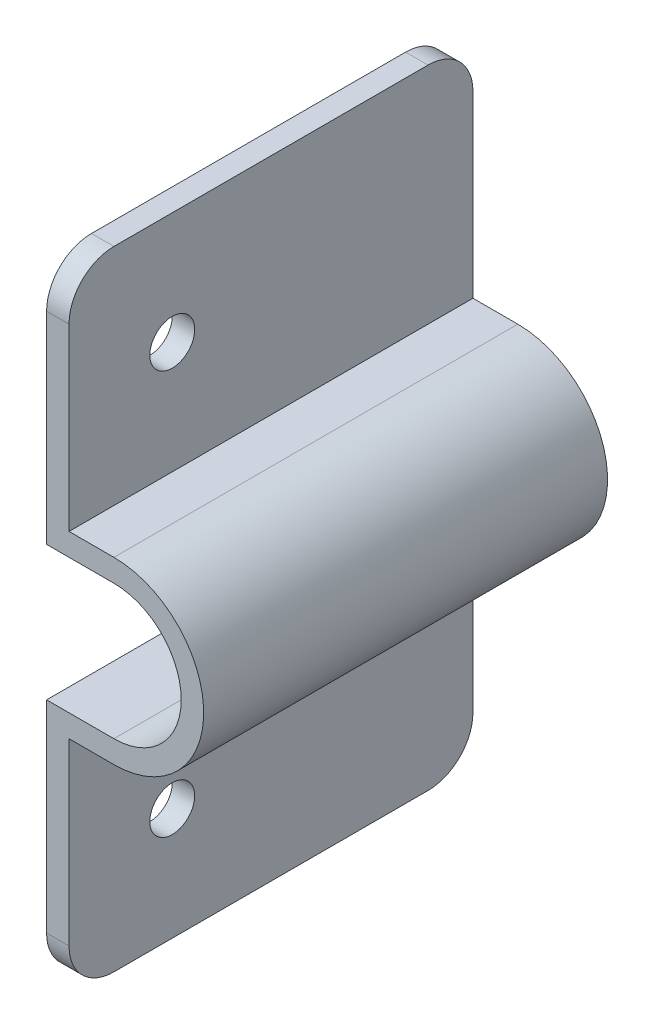
ISO-10303-21;
HEADER;
FILE_DESCRIPTION(('STEP AP214'),'2;1');
FILE_NAME('part.step','',(''),(''),'','','');
FILE_SCHEMA(('AUTOMOTIVE_DESIGN { 1 0 10303 214 1 1 1 1 }'));
ENDSEC;
DATA;
#1=APPLICATION_CONTEXT('core data for automotive mechanical design processes');
#2=APPLICATION_PROTOCOL_DEFINITION('international standard','automotive_design',2000,#1);
#3=PRODUCT_CONTEXT('',#1,'mechanical');
#4=PRODUCT('Part','Part','',(#3));
#5=PRODUCT_RELATED_PRODUCT_CATEGORY('part','',(#4));
#6=PRODUCT_DEFINITION_FORMATION('','',#4);
#7=PRODUCT_DEFINITION_CONTEXT('part definition',#1,'design');
#8=PRODUCT_DEFINITION('design','',#6,#7);
#9=PRODUCT_DEFINITION_SHAPE('','',#8);
#10=(LENGTH_UNIT() NAMED_UNIT(*) SI_UNIT(.MILLI.,.METRE.));
#11=(NAMED_UNIT(*) PLANE_ANGLE_UNIT() SI_UNIT($,.RADIAN.));
#12=(NAMED_UNIT(*) SI_UNIT($,.STERADIAN.) SOLID_ANGLE_UNIT());
#13=UNCERTAINTY_MEASURE_WITH_UNIT(LENGTH_MEASURE(1.E-05),#10,'distance_accuracy_value','');
#14=(GEOMETRIC_REPRESENTATION_CONTEXT(3) GLOBAL_UNCERTAINTY_ASSIGNED_CONTEXT((#13)) GLOBAL_UNIT_ASSIGNED_CONTEXT((#10,
#11,#12)) REPRESENTATION_CONTEXT('',''));
#15=CARTESIAN_POINT('',(0.,0.,0.));
#16=DIRECTION('',(0.,0.,1.));
#17=DIRECTION('',(1.,0.,0.));
#18=AXIS2_PLACEMENT_3D('',#15,#16,#17);
#19=CARTESIAN_POINT('',(0.,288.164397321974,-88.9));
#20=DIRECTION('',(0.,1.,0.));
#21=DIRECTION('',(0.,0.,1.));
#22=AXIS2_PLACEMENT_3D('',#19,#20,#21);
#23=PLANE('',#22);
#24=DIRECTION('',(1.,0.,0.));
#25=VECTOR('',#24,1.);
#26=CARTESIAN_POINT('',(0.,288.164397321974,-31.75));
#27=LINE('',#26,#25);
#28=CARTESIAN_POINT('',(10.1599999999996,288.164397321974,-31.75));
#29=VERTEX_POINT('',#28);
#30=CARTESIAN_POINT('',(19.6849999999996,288.164397321974,-31.75));
#31=VERTEX_POINT('',#30);
#32=EDGE_CURVE('E158',#29,#31,#27,.T.);
#33=ORIENTED_EDGE('',*,*,#32,.F.);
#34=DIRECTION('',(0.,0.,1.));
#35=VECTOR('',#34,1.);
#36=CARTESIAN_POINT('',(10.1599999999996,288.164397321974,-88.9));
#37=LINE('',#36,#35);
#38=CARTESIAN_POINT('',(10.1599999999996,288.164397321974,-88.9));
#39=VERTEX_POINT('',#38);
#40=EDGE_CURVE('E171',#39,#29,#37,.T.);
#41=ORIENTED_EDGE('',*,*,#40,.F.);
#42=DIRECTION('',(-1.,0.,0.));
#43=VECTOR('',#42,1.);
#44=CARTESIAN_POINT('',(0.,288.164397321974,-88.9));
#45=LINE('',#44,#43);
#46=CARTESIAN_POINT('',(19.6849999999996,288.164397321974,-88.9));
#47=VERTEX_POINT('',#46);
#48=EDGE_CURVE('E329',#47,#39,#45,.T.);
#49=ORIENTED_EDGE('',*,*,#48,.F.);
#50=DIRECTION('',(0.,0.,1.));
#51=VECTOR('',#50,1.);
#52=CARTESIAN_POINT('',(19.6849999999996,288.164397321974,-88.9));
#53=LINE('',#52,#51);
#54=EDGE_CURVE('E173',#47,#31,#53,.T.);
#55=ORIENTED_EDGE('',*,*,#54,.T.);
#56=EDGE_LOOP('',(#33,#41,#49,#55));
#57=FACE_BOUND('',#56,.T.);
#58=ADVANCED_FACE('F42',(#57),#23,.F.);
#59=CARTESIAN_POINT('',(10.1599999999996,0.,-88.9));
#60=DIRECTION('',(-1.,0.,0.));
#61=DIRECTION('',(0.,-1.,0.));
#62=AXIS2_PLACEMENT_3D('',#59,#60,#61);
#63=PLANE('',#62);
#64=CARTESIAN_POINT('',(10.1599999999996,307.214397321974,-46.355));
#65=DIRECTION('',(1.,0.,0.));
#66=DIRECTION('',(0.,0.,-1.));
#67=AXIS2_PLACEMENT_3D('',#64,#65,#66);
#68=CIRCLE('',#67,3.175);
#69=CARTESIAN_POINT('',(10.1599999999996,307.214397321974,-49.53));
#70=VERTEX_POINT('',#69);
#71=EDGE_CURVE('E336',#70,#70,#68,.T.);
#72=ORIENTED_EDGE('',*,*,#71,.T.);
#73=EDGE_LOOP('',(#72));
#74=FACE_BOUND('',#73,.T.);
#75=DIRECTION('',(0.,-1.,0.));
#76=VECTOR('',#75,1.);
#77=CARTESIAN_POINT('',(10.1599999999996,0.,-31.75));
#78=LINE('',#77,#76);
#79=CARTESIAN_POINT('',(10.1599999999996,316.739397321974,-31.75));
#80=VERTEX_POINT('',#79);
#81=EDGE_CURVE('E154',#80,#29,#78,.T.);
#82=ORIENTED_EDGE('',*,*,#81,.F.);
#83=CARTESIAN_POINT('',(10.1599999999996,316.739397321974,-38.1));
#84=DIRECTION('',(-1.,0.,0.));
#85=DIRECTION('',(0.,-1.,0.));
#86=AXIS2_PLACEMENT_3D('',#83,#84,#85);
#87=CIRCLE('',#86,6.35);
#88=CARTESIAN_POINT('',(10.1599999999996,323.089397321974,-38.1));
#89=VERTEX_POINT('',#88);
#90=EDGE_CURVE('E11',#80,#89,#87,.T.);
#91=ORIENTED_EDGE('',*,*,#90,.T.);
#92=DIRECTION('',(0.,0.,1.));
#93=VECTOR('',#92,1.);
#94=CARTESIAN_POINT('',(10.1599999999996,323.089397321974,-88.9));
#95=LINE('',#94,#93);
#96=CARTESIAN_POINT('',(10.1599999999996,323.089397321974,-82.55));
#97=VERTEX_POINT('',#96);
#98=EDGE_CURVE('E183',#97,#89,#95,.T.);
#99=ORIENTED_EDGE('',*,*,#98,.F.);
#100=CARTESIAN_POINT('',(10.1599999999996,316.739397321974,-82.55));
#101=DIRECTION('',(-1.,0.,0.));
#102=DIRECTION('',(0.,-1.,0.));
#103=AXIS2_PLACEMENT_3D('',#100,#101,#102);
#104=CIRCLE('',#103,6.35);
#105=CARTESIAN_POINT('',(10.1599999999996,316.739397321974,-88.9));
#106=VERTEX_POINT('',#105);
#107=EDGE_CURVE('E251',#97,#106,#104,.T.);
#108=ORIENTED_EDGE('',*,*,#107,.T.);
#109=DIRECTION('',(0.,-1.,0.));
#110=VECTOR('',#109,1.);
#111=CARTESIAN_POINT('',(10.1599999999996,0.,-88.9));
#112=LINE('',#111,#110);
#113=EDGE_CURVE('E179',#106,#39,#112,.T.);
#114=ORIENTED_EDGE('',*,*,#113,.T.);
#115=ORIENTED_EDGE('',*,*,#40,.T.);
#116=EDGE_LOOP('',(#82,#91,#99,#108,#114,#115));
#117=FACE_BOUND('',#116,.T.);
#118=ADVANCED_FACE('F177',(#74,#117),#63,.T.);
#119=CARTESIAN_POINT('',(0.,323.089397321974,-88.9));
#120=DIRECTION('',(0.,-1.,0.));
#121=DIRECTION('',(0.,0.,-1.));
#122=AXIS2_PLACEMENT_3D('',#119,#120,#121);
#123=PLANE('',#122);
#124=ORIENTED_EDGE('',*,*,#98,.T.);
#125=DIRECTION('',(1.,0.,0.));
#126=VECTOR('',#125,1.);
#127=CARTESIAN_POINT('',(13.3349999999996,323.089397321974,-38.1));
#128=LINE('',#127,#126);
#129=CARTESIAN_POINT('',(13.3349999999996,323.089397321974,-38.1));
#130=VERTEX_POINT('',#129);
#131=EDGE_CURVE('E271',#89,#130,#128,.T.);
#132=ORIENTED_EDGE('',*,*,#131,.T.);
#133=DIRECTION('',(0.,0.,1.));
#134=VECTOR('',#133,1.);
#135=CARTESIAN_POINT('',(13.3349999999996,323.089397321974,-88.9));
#136=LINE('',#135,#134);
#137=CARTESIAN_POINT('',(13.3349999999996,323.089397321974,-82.55));
#138=VERTEX_POINT('',#137);
#139=EDGE_CURVE('E191',#138,#130,#136,.T.);
#140=ORIENTED_EDGE('',*,*,#139,.F.);
#141=DIRECTION('',(1.,0.,0.));
#142=VECTOR('',#141,1.);
#143=CARTESIAN_POINT('',(0.,323.089397321974,-82.55));
#144=LINE('',#143,#142);
#145=EDGE_CURVE('E246',#138,#97,#144,.F.);
#146=ORIENTED_EDGE('',*,*,#145,.T.);
#147=EDGE_LOOP('',(#124,#132,#140,#146));
#148=FACE_BOUND('',#147,.T.);
#149=ADVANCED_FACE('F287',(#148),#123,.F.);
#150=CARTESIAN_POINT('',(13.3349999999996,0.,-88.9));
#151=DIRECTION('',(1.,0.,0.));
#152=DIRECTION('',(0.,0.,-1.));
#153=AXIS2_PLACEMENT_3D('',#150,#151,#152);
#154=PLANE('',#153);
#155=CARTESIAN_POINT('',(13.3349999999996,307.214397321974,-46.355));
#156=DIRECTION('',(1.,0.,0.));
#157=DIRECTION('',(0.,0.,-1.));
#158=AXIS2_PLACEMENT_3D('',#155,#156,#157);
#159=CIRCLE('',#158,3.175);
#160=CARTESIAN_POINT('',(13.3349999999996,307.214397321974,-49.53));
#161=VERTEX_POINT('',#160);
#162=EDGE_CURVE('E284',#161,#161,#159,.T.);
#163=ORIENTED_EDGE('',*,*,#162,.F.);
#164=EDGE_LOOP('',(#163));
#165=FACE_BOUND('',#164,.T.);
#166=ORIENTED_EDGE('',*,*,#139,.T.);
#167=CARTESIAN_POINT('',(13.3349999999996,316.739397321974,-38.1));
#168=DIRECTION('',(1.,0.,0.));
#169=DIRECTION('',(0.,0.,-1.));
#170=AXIS2_PLACEMENT_3D('',#167,#168,#169);
#171=CIRCLE('',#170,6.35);
#172=CARTESIAN_POINT('',(13.3349999999996,316.739397321974,-31.75));
#173=VERTEX_POINT('',#172);
#174=EDGE_CURVE('E51',#130,#173,#171,.T.);
#175=ORIENTED_EDGE('',*,*,#174,.T.);
#176=DIRECTION('',(0.,-1.,0.));
#177=VECTOR('',#176,1.);
#178=CARTESIAN_POINT('',(13.3349999999996,0.,-31.75));
#179=LINE('',#178,#177);
#180=CARTESIAN_POINT('',(13.3349999999996,291.339397321974,-31.75));
#181=VERTEX_POINT('',#180);
#182=EDGE_CURVE('E278',#173,#181,#179,.T.);
#183=ORIENTED_EDGE('',*,*,#182,.T.);
#184=DIRECTION('',(0.,0.,1.));
#185=VECTOR('',#184,1.);
#186=CARTESIAN_POINT('',(13.3349999999996,291.339397321974,-88.9));
#187=LINE('',#186,#185);
#188=CARTESIAN_POINT('',(13.3349999999996,291.339397321974,-88.9));
#189=VERTEX_POINT('',#188);
#190=EDGE_CURVE('E199',#189,#181,#187,.T.);
#191=ORIENTED_EDGE('',*,*,#190,.F.);
#192=DIRECTION('',(0.,1.,0.));
#193=VECTOR('',#192,1.);
#194=CARTESIAN_POINT('',(13.3349999999996,0.,-88.9));
#195=LINE('',#194,#193);
#196=CARTESIAN_POINT('',(13.3349999999996,316.739397321974,-88.9));
#197=VERTEX_POINT('',#196);
#198=EDGE_CURVE('E299',#189,#197,#195,.T.);
#199=ORIENTED_EDGE('',*,*,#198,.T.);
#200=CARTESIAN_POINT('',(13.3349999999996,316.739397321974,-82.55));
#201=DIRECTION('',(1.,0.,0.));
#202=DIRECTION('',(0.,0.,-1.));
#203=AXIS2_PLACEMENT_3D('',#200,#201,#202);
#204=CIRCLE('',#203,6.35);
#205=EDGE_CURVE('E249',#197,#138,#204,.T.);
#206=ORIENTED_EDGE('',*,*,#205,.T.);
#207=EDGE_LOOP('',(#166,#175,#183,#191,#199,#206));
#208=FACE_BOUND('',#207,.T.);
#209=ADVANCED_FACE('F277',(#165,#208),#154,.T.);
#210=CARTESIAN_POINT('',(0.,291.339397321974,-88.9));
#211=DIRECTION('',(0.,1.,0.));
#212=DIRECTION('',(0.,0.,1.));
#213=AXIS2_PLACEMENT_3D('',#210,#211,#212);
#214=PLANE('',#213);
#215=ORIENTED_EDGE('',*,*,#190,.T.);
#216=DIRECTION('',(1.,0.,0.));
#217=VECTOR('',#216,1.);
#218=CARTESIAN_POINT('',(0.,291.339397321974,-31.75));
#219=LINE('',#218,#217);
#220=CARTESIAN_POINT('',(19.6849999999996,291.339397321974,-31.75));
#221=VERTEX_POINT('',#220);
#222=EDGE_CURVE('E282',#181,#221,#219,.T.);
#223=ORIENTED_EDGE('',*,*,#222,.T.);
#224=DIRECTION('',(0.,0.,1.));
#225=VECTOR('',#224,1.);
#226=CARTESIAN_POINT('',(19.6849999999996,291.339397321974,-88.9));
#227=LINE('',#226,#225);
#228=CARTESIAN_POINT('',(19.6849999999996,291.339397321974,-88.9));
#229=VERTEX_POINT('',#228);
#230=EDGE_CURVE('E203',#229,#221,#227,.T.);
#231=ORIENTED_EDGE('',*,*,#230,.F.);
#232=DIRECTION('',(-1.,0.,0.));
#233=VECTOR('',#232,1.);
#234=CARTESIAN_POINT('',(0.,291.339397321974,-88.9));
#235=LINE('',#234,#233);
#236=EDGE_CURVE('E302',#229,#189,#235,.T.);
#237=ORIENTED_EDGE('',*,*,#236,.T.);
#238=EDGE_LOOP('',(#215,#223,#231,#237));
#239=FACE_BOUND('',#238,.T.);
#240=ADVANCED_FACE('F395',(#239),#214,.T.);
#241=CARTESIAN_POINT('',(19.6849999999996,278.639397321974,-88.9));
#242=DIRECTION('',(0.,0.,1.));
#243=DIRECTION('',(1.,0.,0.));
#244=AXIS2_PLACEMENT_3D('',#241,#242,#243);
#245=CYLINDRICAL_SURFACE('',#244,12.7);
#246=ORIENTED_EDGE('',*,*,#230,.T.);
#247=CARTESIAN_POINT('',(19.6849999999996,278.639397321974,-31.75));
#248=DIRECTION('',(0.,0.,1.));
#249=DIRECTION('',(0.,-1.,0.));
#250=AXIS2_PLACEMENT_3D('',#247,#248,#249);
#251=CIRCLE('',#250,12.7);
#252=CARTESIAN_POINT('',(19.6849999999996,265.939397321974,-31.75));
#253=VERTEX_POINT('',#252);
#254=EDGE_CURVE('E348',#221,#253,#251,.F.);
#255=ORIENTED_EDGE('',*,*,#254,.T.);
#256=DIRECTION('',(0.,0.,1.));
#257=VECTOR('',#256,1.);
#258=CARTESIAN_POINT('',(19.6849999999996,265.939397321974,-88.9));
#259=LINE('',#258,#257);
#260=CARTESIAN_POINT('',(19.6849999999996,265.939397321974,-88.9));
#261=VERTEX_POINT('',#260);
#262=EDGE_CURVE('E207',#261,#253,#259,.T.);
#263=ORIENTED_EDGE('',*,*,#262,.F.);
#264=CARTESIAN_POINT('',(19.6849999999996,278.639397321974,-88.9));
#265=DIRECTION('',(0.,0.,1.));
#266=DIRECTION('',(1.,0.,0.));
#267=AXIS2_PLACEMENT_3D('',#264,#265,#266);
#268=CIRCLE('',#267,12.7);
#269=EDGE_CURVE('E305',#261,#229,#268,.T.);
#270=ORIENTED_EDGE('',*,*,#269,.T.);
#271=EDGE_LOOP('',(#246,#255,#263,#270));
#272=FACE_BOUND('',#271,.T.);
#273=ADVANCED_FACE('F393',(#272),#245,.T.);
#274=CARTESIAN_POINT('',(0.,265.939397321974,-88.9));
#275=DIRECTION('',(0.,1.,0.));
#276=DIRECTION('',(0.,0.,1.));
#277=AXIS2_PLACEMENT_3D('',#274,#275,#276);
#278=PLANE('',#277);
#279=DIRECTION('',(1.,0.,0.));
#280=VECTOR('',#279,1.);
#281=CARTESIAN_POINT('',(0.,265.939397321974,-31.75));
#282=LINE('',#281,#280);
#283=CARTESIAN_POINT('',(13.3349999999996,265.939397321974,-31.75));
#284=VERTEX_POINT('',#283);
#285=EDGE_CURVE('E350',#284,#253,#282,.T.);
#286=ORIENTED_EDGE('',*,*,#285,.F.);
#287=DIRECTION('',(0.,0.,1.));
#288=VECTOR('',#287,1.);
#289=CARTESIAN_POINT('',(13.3349999999996,265.939397321974,-88.9));
#290=LINE('',#289,#288);
#291=CARTESIAN_POINT('',(13.3349999999996,265.939397321974,-88.9));
#292=VERTEX_POINT('',#291);
#293=EDGE_CURVE('E211',#292,#284,#290,.T.);
#294=ORIENTED_EDGE('',*,*,#293,.F.);
#295=DIRECTION('',(-1.,0.,0.));
#296=VECTOR('',#295,1.);
#297=CARTESIAN_POINT('',(0.,265.939397321974,-88.9));
#298=LINE('',#297,#296);
#299=EDGE_CURVE('E311',#261,#292,#298,.T.);
#300=ORIENTED_EDGE('',*,*,#299,.F.);
#301=ORIENTED_EDGE('',*,*,#262,.T.);
#302=EDGE_LOOP('',(#286,#294,#300,#301));
#303=FACE_BOUND('',#302,.T.);
#304=ADVANCED_FACE('F389',(#303),#278,.F.);
#305=CARTESIAN_POINT('',(13.3349999999996,0.,-88.9));
#306=DIRECTION('',(1.,0.,0.));
#307=DIRECTION('',(0.,0.,-1.));
#308=AXIS2_PLACEMENT_3D('',#305,#306,#307);
#309=PLANE('',#308);
#310=CARTESIAN_POINT('',(13.3349999999996,250.064397321974,-46.355));
#311=DIRECTION('',(1.,0.,0.));
#312=DIRECTION('',(0.,0.,-1.));
#313=AXIS2_PLACEMENT_3D('',#310,#311,#312);
#314=CIRCLE('',#313,3.175);
#315=CARTESIAN_POINT('',(13.3349999999996,250.064397321974,-49.53));
#316=VERTEX_POINT('',#315);
#317=EDGE_CURVE('E339',#316,#316,#314,.T.);
#318=ORIENTED_EDGE('',*,*,#317,.F.);
#319=EDGE_LOOP('',(#318));
#320=FACE_BOUND('',#319,.T.);
#321=DIRECTION('',(0.,-1.,0.));
#322=VECTOR('',#321,1.);
#323=CARTESIAN_POINT('',(13.3349999999996,0.,-31.75));
#324=LINE('',#323,#322);
#325=CARTESIAN_POINT('',(13.3349999999996,240.539397321974,-31.75));
#326=VERTEX_POINT('',#325);
#327=EDGE_CURVE('E175',#284,#326,#324,.T.);
#328=ORIENTED_EDGE('',*,*,#327,.T.);
#329=CARTESIAN_POINT('',(13.3349999999996,240.539397321974,-38.1));
#330=DIRECTION('',(1.,0.,0.));
#331=DIRECTION('',(0.,0.,-1.));
#332=AXIS2_PLACEMENT_3D('',#329,#330,#331);
#333=CIRCLE('',#332,6.35);
#334=CARTESIAN_POINT('',(13.3349999999996,234.189397321974,-38.1));
#335=VERTEX_POINT('',#334);
#336=EDGE_CURVE('E263',#326,#335,#333,.T.);
#337=ORIENTED_EDGE('',*,*,#336,.T.);
#338=DIRECTION('',(0.,0.,1.));
#339=VECTOR('',#338,1.);
#340=CARTESIAN_POINT('',(13.3349999999996,234.189397321974,-88.9));
#341=LINE('',#340,#339);
#342=CARTESIAN_POINT('',(13.3349999999996,234.189397321974,-82.55));
#343=VERTEX_POINT('',#342);
#344=EDGE_CURVE('E215',#343,#335,#341,.T.);
#345=ORIENTED_EDGE('',*,*,#344,.F.);
#346=CARTESIAN_POINT('',(13.3349999999996,240.539397321974,-82.55));
#347=DIRECTION('',(1.,0.,0.));
#348=DIRECTION('',(0.,0.,-1.));
#349=AXIS2_PLACEMENT_3D('',#346,#347,#348);
#350=CIRCLE('',#349,6.35);
#351=CARTESIAN_POINT('',(13.3349999999996,240.539397321974,-88.9));
#352=VERTEX_POINT('',#351);
#353=EDGE_CURVE('E182',#343,#352,#350,.T.);
#354=ORIENTED_EDGE('',*,*,#353,.T.);
#355=DIRECTION('',(0.,1.,0.));
#356=VECTOR('',#355,1.);
#357=CARTESIAN_POINT('',(13.3349999999996,0.,-88.9));
#358=LINE('',#357,#356);
#359=EDGE_CURVE('E315',#352,#292,#358,.T.);
#360=ORIENTED_EDGE('',*,*,#359,.T.);
#361=ORIENTED_EDGE('',*,*,#293,.T.);
#362=EDGE_LOOP('',(#328,#337,#345,#354,#360,#361));
#363=FACE_BOUND('',#362,.T.);
#364=ADVANCED_FACE('F380',(#320,#363),#309,.T.);
#365=CARTESIAN_POINT('',(0.,234.189397321974,-88.9));
#366=DIRECTION('',(0.,-1.,0.));
#367=DIRECTION('',(0.,0.,-1.));
#368=AXIS2_PLACEMENT_3D('',#365,#366,#367);
#369=PLANE('',#368);
#370=ORIENTED_EDGE('',*,*,#344,.T.);
#371=DIRECTION('',(1.,0.,0.));
#372=VECTOR('',#371,1.);
#373=CARTESIAN_POINT('',(0.,234.189397321974,-38.1));
#374=LINE('',#373,#372);
#375=CARTESIAN_POINT('',(10.1599999999996,234.189397321974,-38.1));
#376=VERTEX_POINT('',#375);
#377=EDGE_CURVE('E265',#335,#376,#374,.F.);
#378=ORIENTED_EDGE('',*,*,#377,.T.);
#379=DIRECTION('',(0.,0.,1.));
#380=VECTOR('',#379,1.);
#381=CARTESIAN_POINT('',(10.1599999999996,234.189397321974,-88.9));
#382=LINE('',#381,#380);
#383=CARTESIAN_POINT('',(10.1599999999996,234.189397321974,-82.55));
#384=VERTEX_POINT('',#383);
#385=EDGE_CURVE('E219',#384,#376,#382,.T.);
#386=ORIENTED_EDGE('',*,*,#385,.F.);
#387=DIRECTION('',(1.,0.,0.));
#388=VECTOR('',#387,1.);
#389=CARTESIAN_POINT('',(13.3349999999996,234.189397321974,-82.55));
#390=LINE('',#389,#388);
#391=EDGE_CURVE('E188',#384,#343,#390,.T.);
#392=ORIENTED_EDGE('',*,*,#391,.T.);
#393=EDGE_LOOP('',(#370,#378,#386,#392));
#394=FACE_BOUND('',#393,.T.);
#395=ADVANCED_FACE('F377',(#394),#369,.T.);
#396=CARTESIAN_POINT('',(10.1599999999996,0.,-88.9));
#397=DIRECTION('',(-1.,0.,0.));
#398=DIRECTION('',(0.,-1.,0.));
#399=AXIS2_PLACEMENT_3D('',#396,#397,#398);
#400=PLANE('',#399);
#401=CARTESIAN_POINT('',(10.1599999999996,250.064397321974,-46.355));
#402=DIRECTION('',(1.,0.,0.));
#403=DIRECTION('',(0.,0.,-1.));
#404=AXIS2_PLACEMENT_3D('',#401,#402,#403);
#405=CIRCLE('',#404,3.175);
#406=CARTESIAN_POINT('',(10.1599999999996,250.064397321974,-49.53));
#407=VERTEX_POINT('',#406);
#408=EDGE_CURVE('E332',#407,#407,#405,.T.);
#409=ORIENTED_EDGE('',*,*,#408,.T.);
#410=EDGE_LOOP('',(#409));
#411=FACE_BOUND('',#410,.T.);
#412=ORIENTED_EDGE('',*,*,#385,.T.);
#413=CARTESIAN_POINT('',(10.1599999999996,240.539397321974,-38.1));
#414=DIRECTION('',(-1.,0.,0.));
#415=DIRECTION('',(0.,-1.,0.));
#416=AXIS2_PLACEMENT_3D('',#413,#414,#415);
#417=CIRCLE('',#416,6.35);
#418=CARTESIAN_POINT('',(10.1599999999996,240.539397321974,-31.75));
#419=VERTEX_POINT('',#418);
#420=EDGE_CURVE('E268',#376,#419,#417,.T.);
#421=ORIENTED_EDGE('',*,*,#420,.T.);
#422=CARTESIAN_POINT('',(10.1599999999996,269.114397321974,-31.75));
#423=VERTEX_POINT('',#422);
#424=EDGE_CURVE('E165',#423,#419,#78,.T.);
#425=ORIENTED_EDGE('',*,*,#424,.F.);
#426=DIRECTION('',(0.,0.,1.));
#427=VECTOR('',#426,1.);
#428=CARTESIAN_POINT('',(10.1599999999996,269.114397321974,-88.9));
#429=LINE('',#428,#427);
#430=CARTESIAN_POINT('',(10.1599999999996,269.114397321974,-88.9));
#431=VERTEX_POINT('',#430);
#432=EDGE_CURVE('E223',#431,#423,#429,.T.);
#433=ORIENTED_EDGE('',*,*,#432,.F.);
#434=DIRECTION('',(0.,-1.,0.));
#435=VECTOR('',#434,1.);
#436=CARTESIAN_POINT('',(10.1599999999996,0.,-88.9));
#437=LINE('',#436,#435);
#438=CARTESIAN_POINT('',(10.1599999999996,240.539397321974,-88.9));
#439=VERTEX_POINT('',#438);
#440=EDGE_CURVE('E318',#431,#439,#437,.T.);
#441=ORIENTED_EDGE('',*,*,#440,.T.);
#442=CARTESIAN_POINT('',(10.1599999999996,240.539397321974,-82.55));
#443=DIRECTION('',(-1.,0.,0.));
#444=DIRECTION('',(0.,-1.,0.));
#445=AXIS2_PLACEMENT_3D('',#442,#443,#444);
#446=CIRCLE('',#445,6.35);
#447=EDGE_CURVE('E236',#439,#384,#446,.T.);
#448=ORIENTED_EDGE('',*,*,#447,.T.);
#449=EDGE_LOOP('',(#412,#421,#425,#433,#441,#448));
#450=FACE_BOUND('',#449,.T.);
#451=ADVANCED_FACE('F370',(#411,#450),#400,.T.);
#452=CARTESIAN_POINT('',(0.,269.114397321974,-88.9));
#453=DIRECTION('',(0.,1.,0.));
#454=DIRECTION('',(0.,0.,1.));
#455=AXIS2_PLACEMENT_3D('',#452,#453,#454);
#456=PLANE('',#455);
#457=ORIENTED_EDGE('',*,*,#432,.T.);
#458=DIRECTION('',(1.,0.,0.));
#459=VECTOR('',#458,1.);
#460=CARTESIAN_POINT('',(0.,269.114397321974,-31.75));
#461=LINE('',#460,#459);
#462=CARTESIAN_POINT('',(19.6849999999996,269.114397321974,-31.75));
#463=VERTEX_POINT('',#462);
#464=EDGE_CURVE('E164',#423,#463,#461,.T.);
#465=ORIENTED_EDGE('',*,*,#464,.T.);
#466=DIRECTION('',(0.,0.,1.));
#467=VECTOR('',#466,1.);
#468=CARTESIAN_POINT('',(19.6849999999996,269.114397321974,-88.9));
#469=LINE('',#468,#467);
#470=CARTESIAN_POINT('',(19.6849999999996,269.114397321974,-88.9));
#471=VERTEX_POINT('',#470);
#472=EDGE_CURVE('E227',#471,#463,#469,.T.);
#473=ORIENTED_EDGE('',*,*,#472,.F.);
#474=DIRECTION('',(-1.,0.,0.));
#475=VECTOR('',#474,1.);
#476=CARTESIAN_POINT('',(0.,269.114397321974,-88.9));
#477=LINE('',#476,#475);
#478=EDGE_CURVE('E322',#471,#431,#477,.T.);
#479=ORIENTED_EDGE('',*,*,#478,.T.);
#480=EDGE_LOOP('',(#457,#465,#473,#479));
#481=FACE_BOUND('',#480,.T.);
#482=ADVANCED_FACE('F360',(#481),#456,.T.);
#483=CARTESIAN_POINT('',(19.6849999999996,278.639397321974,-88.9));
#484=DIRECTION('',(0.,0.,1.));
#485=DIRECTION('',(1.,0.,0.));
#486=AXIS2_PLACEMENT_3D('',#483,#484,#485);
#487=CYLINDRICAL_SURFACE('',#486,9.525);
#488=CARTESIAN_POINT('',(19.6849999999996,278.639397321974,-31.75));
#489=DIRECTION('',(0.,0.,1.));
#490=DIRECTION('',(0.,-1.,0.));
#491=AXIS2_PLACEMENT_3D('',#488,#489,#490);
#492=CIRCLE('',#491,9.525);
#493=EDGE_CURVE('E254',#31,#463,#492,.F.);
#494=ORIENTED_EDGE('',*,*,#493,.F.);
#495=ORIENTED_EDGE('',*,*,#54,.F.);
#496=CARTESIAN_POINT('',(19.6849999999996,278.639397321974,-88.9));
#497=DIRECTION('',(0.,0.,1.));
#498=DIRECTION('',(1.,0.,0.));
#499=AXIS2_PLACEMENT_3D('',#496,#497,#498);
#500=CIRCLE('',#499,9.525);
#501=EDGE_CURVE('E326',#471,#47,#500,.T.);
#502=ORIENTED_EDGE('',*,*,#501,.F.);
#503=ORIENTED_EDGE('',*,*,#472,.T.);
#504=EDGE_LOOP('',(#494,#495,#502,#503));
#505=FACE_BOUND('',#504,.T.);
#506=ADVANCED_FACE('F364',(#505),#487,.F.);
#507=CARTESIAN_POINT('',(0.,0.,-88.9));
#508=DIRECTION('',(0.,0.,1.));
#509=DIRECTION('',(1.,0.,0.));
#510=AXIS2_PLACEMENT_3D('',#507,#508,#509);
#511=PLANE('',#510);
#512=ORIENTED_EDGE('',*,*,#359,.F.);
#513=DIRECTION('',(1.,0.,0.));
#514=VECTOR('',#513,1.);
#515=CARTESIAN_POINT('',(10.1599999999996,240.539397321974,-88.9));
#516=LINE('',#515,#514);
#517=EDGE_CURVE('E243',#352,#439,#516,.F.);
#518=ORIENTED_EDGE('',*,*,#517,.T.);
#519=ORIENTED_EDGE('',*,*,#440,.F.);
#520=ORIENTED_EDGE('',*,*,#478,.F.);
#521=ORIENTED_EDGE('',*,*,#501,.T.);
#522=ORIENTED_EDGE('',*,*,#48,.T.);
#523=ORIENTED_EDGE('',*,*,#113,.F.);
#524=DIRECTION('',(1.,0.,0.));
#525=VECTOR('',#524,1.);
#526=CARTESIAN_POINT('',(0.,316.739397321974,-88.9));
#527=LINE('',#526,#525);
#528=EDGE_CURVE('E239',#106,#197,#527,.T.);
#529=ORIENTED_EDGE('',*,*,#528,.T.);
#530=ORIENTED_EDGE('',*,*,#198,.F.);
#531=ORIENTED_EDGE('',*,*,#236,.F.);
#532=ORIENTED_EDGE('',*,*,#269,.F.);
#533=ORIENTED_EDGE('',*,*,#299,.T.);
#534=EDGE_LOOP('',(#512,#518,#519,#520,#521,#522,#523,#529,#530,#531,#532,#533));
#535=FACE_BOUND('',#534,.T.);
#536=ADVANCED_FACE('F297',(#535),#511,.F.);
#537=CARTESIAN_POINT('',(10.1599999999996,250.064397321974,-46.355));
#538=DIRECTION('',(1.,0.,0.));
#539=DIRECTION('',(0.,0.,-1.));
#540=AXIS2_PLACEMENT_3D('',#537,#538,#539);
#541=CYLINDRICAL_SURFACE('',#540,3.175);
#542=ORIENTED_EDGE('',*,*,#408,.F.);
#543=EDGE_LOOP('',(#542));
#544=FACE_BOUND('',#543,.T.);
#545=ORIENTED_EDGE('',*,*,#317,.T.);
#546=EDGE_LOOP('',(#545));
#547=FACE_BOUND('',#546,.T.);
#548=ADVANCED_FACE('F428',(#544,#547),#541,.F.);
#549=CARTESIAN_POINT('',(10.1599999999996,307.214397321974,-46.355));
#550=DIRECTION('',(1.,0.,0.));
#551=DIRECTION('',(0.,0.,-1.));
#552=AXIS2_PLACEMENT_3D('',#549,#550,#551);
#553=CYLINDRICAL_SURFACE('',#552,3.175);
#554=ORIENTED_EDGE('',*,*,#71,.F.);
#555=EDGE_LOOP('',(#554));
#556=FACE_BOUND('',#555,.T.);
#557=ORIENTED_EDGE('',*,*,#162,.T.);
#558=EDGE_LOOP('',(#557));
#559=FACE_BOUND('',#558,.T.);
#560=ADVANCED_FACE('F417',(#556,#559),#553,.F.);
#561=CARTESIAN_POINT('',(0.,240.539397321974,-82.55));
#562=DIRECTION('',(-1.,0.,0.));
#563=DIRECTION('',(0.,0.,1.));
#564=AXIS2_PLACEMENT_3D('',#561,#562,#563);
#565=CYLINDRICAL_SURFACE('',#564,6.35);
#566=ORIENTED_EDGE('',*,*,#447,.F.);
#567=ORIENTED_EDGE('',*,*,#517,.F.);
#568=ORIENTED_EDGE('',*,*,#353,.F.);
#569=ORIENTED_EDGE('',*,*,#391,.F.);
#570=EDGE_LOOP('',(#566,#567,#568,#569));
#571=FACE_BOUND('',#570,.T.);
#572=ADVANCED_FACE('F374',(#571),#565,.T.);
#573=CARTESIAN_POINT('',(0.,316.739397321974,-82.55));
#574=DIRECTION('',(1.,0.,0.));
#575=DIRECTION('',(0.,0.,-1.));
#576=AXIS2_PLACEMENT_3D('',#573,#574,#575);
#577=CYLINDRICAL_SURFACE('',#576,6.35);
#578=ORIENTED_EDGE('',*,*,#107,.F.);
#579=ORIENTED_EDGE('',*,*,#145,.F.);
#580=ORIENTED_EDGE('',*,*,#205,.F.);
#581=ORIENTED_EDGE('',*,*,#528,.F.);
#582=EDGE_LOOP('',(#578,#579,#580,#581));
#583=FACE_BOUND('',#582,.T.);
#584=ADVANCED_FACE('F292',(#583),#577,.T.);
#585=CARTESIAN_POINT('',(10.1599999999996,0.,-31.75));
#586=DIRECTION('',(0.,0.,1.));
#587=DIRECTION('',(0.,-1.,0.));
#588=AXIS2_PLACEMENT_3D('',#585,#586,#587);
#589=PLANE('',#588);
#590=ORIENTED_EDGE('',*,*,#424,.T.);
#591=DIRECTION('',(1.,0.,0.));
#592=VECTOR('',#591,1.);
#593=CARTESIAN_POINT('',(10.1599999999996,240.539397321974,-31.75));
#594=LINE('',#593,#592);
#595=EDGE_CURVE('E259',#419,#326,#594,.T.);
#596=ORIENTED_EDGE('',*,*,#595,.T.);
#597=ORIENTED_EDGE('',*,*,#327,.F.);
#598=ORIENTED_EDGE('',*,*,#285,.T.);
#599=ORIENTED_EDGE('',*,*,#254,.F.);
#600=ORIENTED_EDGE('',*,*,#222,.F.);
#601=ORIENTED_EDGE('',*,*,#182,.F.);
#602=DIRECTION('',(1.,0.,0.));
#603=VECTOR('',#602,1.);
#604=CARTESIAN_POINT('',(10.1599999999996,316.739397321974,-31.75));
#605=LINE('',#604,#603);
#606=EDGE_CURVE('E161',#173,#80,#605,.F.);
#607=ORIENTED_EDGE('',*,*,#606,.T.);
#608=ORIENTED_EDGE('',*,*,#81,.T.);
#609=ORIENTED_EDGE('',*,*,#32,.T.);
#610=ORIENTED_EDGE('',*,*,#493,.T.);
#611=ORIENTED_EDGE('',*,*,#464,.F.);
#612=EDGE_LOOP('',(#590,#596,#597,#598,#599,#600,#601,#607,#608,#609,#610,#611));
#613=FACE_BOUND('',#612,.T.);
#614=ADVANCED_FACE('F157',(#613),#589,.T.);
#615=CARTESIAN_POINT('',(10.1599999999996,240.539397321974,-38.1));
#616=DIRECTION('',(1.,0.,0.));
#617=DIRECTION('',(0.,0.,-1.));
#618=AXIS2_PLACEMENT_3D('',#615,#616,#617);
#619=CYLINDRICAL_SURFACE('',#618,6.35);
#620=ORIENTED_EDGE('',*,*,#420,.F.);
#621=ORIENTED_EDGE('',*,*,#377,.F.);
#622=ORIENTED_EDGE('',*,*,#336,.F.);
#623=ORIENTED_EDGE('',*,*,#595,.F.);
#624=EDGE_LOOP('',(#620,#621,#622,#623));
#625=FACE_BOUND('',#624,.T.);
#626=ADVANCED_FACE('F384',(#625),#619,.T.);
#627=CARTESIAN_POINT('',(0.,316.739397321974,-38.1));
#628=DIRECTION('',(-1.,0.,0.));
#629=DIRECTION('',(0.,0.,1.));
#630=AXIS2_PLACEMENT_3D('',#627,#628,#629);
#631=CYLINDRICAL_SURFACE('',#630,6.35);
#632=ORIENTED_EDGE('',*,*,#90,.F.);
#633=ORIENTED_EDGE('',*,*,#606,.F.);
#634=ORIENTED_EDGE('',*,*,#174,.F.);
#635=ORIENTED_EDGE('',*,*,#131,.F.);
#636=EDGE_LOOP('',(#632,#633,#634,#635));
#637=FACE_BOUND('',#636,.T.);
#638=ADVANCED_FACE('F44',(#637),#631,.T.);
#639=CLOSED_SHELL('',(#58,#118,#149,#209,#240,#273,#304,#364,#395,#451,#482,#506,#536,#548,#560,
#572,#584,#614,#626,#638));
#640=MANIFOLD_SOLID_BREP('B2',#639);
#641=ADVANCED_BREP_SHAPE_REPRESENTATION('',(#18,#640),#14);
#642=SHAPE_DEFINITION_REPRESENTATION(#9,#641);
ENDSEC;
END-ISO-10303-21;
